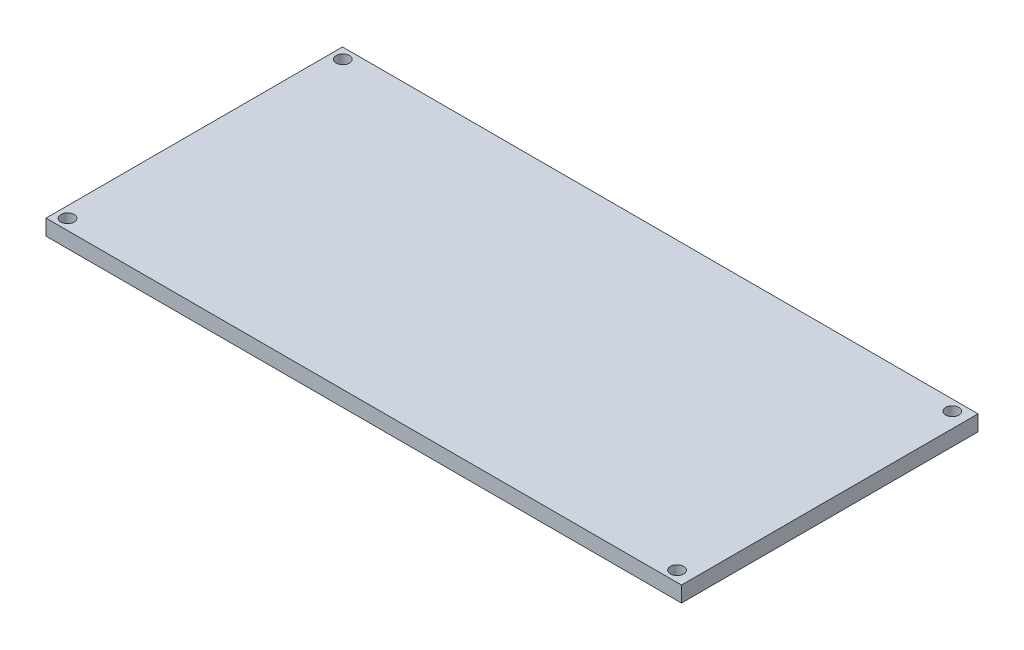
ISO-10303-21;
HEADER;
FILE_DESCRIPTION(('STEP AP214'),'2;1');
FILE_NAME('part.step','',(''),(''),'','','');
FILE_SCHEMA(('AUTOMOTIVE_DESIGN { 1 0 10303 214 1 1 1 1 }'));
ENDSEC;
DATA;
#1=APPLICATION_CONTEXT('core data for automotive mechanical design processes');
#2=APPLICATION_PROTOCOL_DEFINITION('international standard','automotive_design',2000,#1);
#3=PRODUCT_CONTEXT('',#1,'mechanical');
#4=PRODUCT('Part','Part','',(#3));
#5=PRODUCT_RELATED_PRODUCT_CATEGORY('part','',(#4));
#6=PRODUCT_DEFINITION_FORMATION('','',#4);
#7=PRODUCT_DEFINITION_CONTEXT('part definition',#1,'design');
#8=PRODUCT_DEFINITION('design','',#6,#7);
#9=PRODUCT_DEFINITION_SHAPE('','',#8);
#10=(LENGTH_UNIT() NAMED_UNIT(*) SI_UNIT(.MILLI.,.METRE.));
#11=(NAMED_UNIT(*) PLANE_ANGLE_UNIT() SI_UNIT($,.RADIAN.));
#12=(NAMED_UNIT(*) SI_UNIT($,.STERADIAN.) SOLID_ANGLE_UNIT());
#13=UNCERTAINTY_MEASURE_WITH_UNIT(LENGTH_MEASURE(1.E-05),#10,'distance_accuracy_value','');
#14=(GEOMETRIC_REPRESENTATION_CONTEXT(3) GLOBAL_UNCERTAINTY_ASSIGNED_CONTEXT((#13)) GLOBAL_UNIT_ASSIGNED_CONTEXT((#10,
#11,#12)) REPRESENTATION_CONTEXT('',''));
#15=CARTESIAN_POINT('',(0.,0.,0.));
#16=DIRECTION('',(0.,0.,1.));
#17=DIRECTION('',(1.,0.,0.));
#18=AXIS2_PLACEMENT_3D('',#15,#16,#17);
#19=CARTESIAN_POINT('',(-56.86,2.95,-27.95));
#20=DIRECTION('',(1.,0.,0.));
#21=DIRECTION('',(0.,0.,-1.));
#22=AXIS2_PLACEMENT_3D('',#19,#20,#21);
#23=PLANE('',#22);
#24=DIRECTION('',(0.,0.,1.));
#25=VECTOR('',#24,1.);
#26=CARTESIAN_POINT('',(-56.86,0.,-27.95));
#27=LINE('',#26,#25);
#28=CARTESIAN_POINT('',(-56.86,0.,-27.95));
#29=VERTEX_POINT('',#28);
#30=CARTESIAN_POINT('',(-56.86,0.,27.95));
#31=VERTEX_POINT('',#30);
#32=EDGE_CURVE('E99',#29,#31,#27,.T.);
#33=ORIENTED_EDGE('',*,*,#32,.T.);
#34=DIRECTION('',(0.,-1.,0.));
#35=VECTOR('',#34,1.);
#36=CARTESIAN_POINT('',(-56.86,2.95,27.95));
#37=LINE('',#36,#35);
#38=CARTESIAN_POINT('',(-56.86,2.95,27.95));
#39=VERTEX_POINT('',#38);
#40=EDGE_CURVE('E11',#39,#31,#37,.T.);
#41=ORIENTED_EDGE('',*,*,#40,.F.);
#42=DIRECTION('',(0.,0.,1.));
#43=VECTOR('',#42,1.);
#44=CARTESIAN_POINT('',(-56.86,2.95,-27.95));
#45=LINE('',#44,#43);
#46=CARTESIAN_POINT('',(-56.86,2.95,-27.95));
#47=VERTEX_POINT('',#46);
#48=EDGE_CURVE('E86',#47,#39,#45,.T.);
#49=ORIENTED_EDGE('',*,*,#48,.F.);
#50=DIRECTION('',(0.,-1.,0.));
#51=VECTOR('',#50,1.);
#52=CARTESIAN_POINT('',(-56.86,2.95,-27.95));
#53=LINE('',#52,#51);
#54=EDGE_CURVE('E95',#47,#29,#53,.T.);
#55=ORIENTED_EDGE('',*,*,#54,.T.);
#56=EDGE_LOOP('',(#33,#41,#49,#55));
#57=FACE_BOUND('',#56,.T.);
#58=ADVANCED_FACE('F33',(#57),#23,.F.);
#59=CARTESIAN_POINT('',(-56.86,2.95,27.95));
#60=DIRECTION('',(0.,0.,-1.));
#61=DIRECTION('',(-1.,0.,0.));
#62=AXIS2_PLACEMENT_3D('',#59,#60,#61);
#63=PLANE('',#62);
#64=DIRECTION('',(1.,0.,0.));
#65=VECTOR('',#64,1.);
#66=CARTESIAN_POINT('',(-56.86,0.,27.95));
#67=LINE('',#66,#65);
#68=CARTESIAN_POINT('',(62.95,0.,27.95));
#69=VERTEX_POINT('',#68);
#70=EDGE_CURVE('E90',#31,#69,#67,.T.);
#71=ORIENTED_EDGE('',*,*,#70,.T.);
#72=DIRECTION('',(0.,-1.,0.));
#73=VECTOR('',#72,1.);
#74=CARTESIAN_POINT('',(62.95,2.95,27.95));
#75=LINE('',#74,#73);
#76=CARTESIAN_POINT('',(62.95,2.95,27.95));
#77=VERTEX_POINT('',#76);
#78=EDGE_CURVE('E42',#77,#69,#75,.T.);
#79=ORIENTED_EDGE('',*,*,#78,.F.);
#80=DIRECTION('',(1.,0.,0.));
#81=VECTOR('',#80,1.);
#82=CARTESIAN_POINT('',(-56.86,2.95,27.95));
#83=LINE('',#82,#81);
#84=EDGE_CURVE('E81',#39,#77,#83,.T.);
#85=ORIENTED_EDGE('',*,*,#84,.F.);
#86=ORIENTED_EDGE('',*,*,#40,.T.);
#87=EDGE_LOOP('',(#71,#79,#85,#86));
#88=FACE_BOUND('',#87,.T.);
#89=ADVANCED_FACE('F89',(#88),#63,.F.);
#90=CARTESIAN_POINT('',(62.95,2.95,-27.95));
#91=DIRECTION('',(-1.,0.,0.));
#92=DIRECTION('',(0.,0.,1.));
#93=AXIS2_PLACEMENT_3D('',#90,#91,#92);
#94=PLANE('',#93);
#95=DIRECTION('',(0.,0.,-1.));
#96=VECTOR('',#95,1.);
#97=CARTESIAN_POINT('',(62.95,0.,-27.95));
#98=LINE('',#97,#96);
#99=CARTESIAN_POINT('',(62.95,0.,-27.95));
#100=VERTEX_POINT('',#99);
#101=EDGE_CURVE('E68',#69,#100,#98,.T.);
#102=ORIENTED_EDGE('',*,*,#101,.T.);
#103=DIRECTION('',(0.,-1.,0.));
#104=VECTOR('',#103,1.);
#105=CARTESIAN_POINT('',(62.95,2.95,-27.95));
#106=LINE('',#105,#104);
#107=CARTESIAN_POINT('',(62.95,2.95,-27.95));
#108=VERTEX_POINT('',#107);
#109=EDGE_CURVE('E91',#108,#100,#106,.T.);
#110=ORIENTED_EDGE('',*,*,#109,.F.);
#111=DIRECTION('',(0.,0.,-1.));
#112=VECTOR('',#111,1.);
#113=CARTESIAN_POINT('',(62.95,2.95,-27.95));
#114=LINE('',#113,#112);
#115=EDGE_CURVE('E84',#77,#108,#114,.T.);
#116=ORIENTED_EDGE('',*,*,#115,.F.);
#117=ORIENTED_EDGE('',*,*,#78,.T.);
#118=EDGE_LOOP('',(#102,#110,#116,#117));
#119=FACE_BOUND('',#118,.T.);
#120=ADVANCED_FACE('F93',(#119),#94,.F.);
#121=CARTESIAN_POINT('',(-56.86,2.95,-27.95));
#122=DIRECTION('',(0.,0.,1.));
#123=DIRECTION('',(1.,0.,0.));
#124=AXIS2_PLACEMENT_3D('',#121,#122,#123);
#125=PLANE('',#124);
#126=DIRECTION('',(-1.,0.,0.));
#127=VECTOR('',#126,1.);
#128=CARTESIAN_POINT('',(-56.86,0.,-27.95));
#129=LINE('',#128,#127);
#130=EDGE_CURVE('E74',#100,#29,#129,.T.);
#131=ORIENTED_EDGE('',*,*,#130,.T.);
#132=ORIENTED_EDGE('',*,*,#54,.F.);
#133=DIRECTION('',(-1.,0.,0.));
#134=VECTOR('',#133,1.);
#135=CARTESIAN_POINT('',(-56.86,2.95,-27.95));
#136=LINE('',#135,#134);
#137=EDGE_CURVE('E51',#108,#47,#136,.T.);
#138=ORIENTED_EDGE('',*,*,#137,.F.);
#139=ORIENTED_EDGE('',*,*,#109,.T.);
#140=EDGE_LOOP('',(#131,#132,#138,#139));
#141=FACE_BOUND('',#140,.T.);
#142=ADVANCED_FACE('F151',(#141),#125,.F.);
#143=CARTESIAN_POINT('',(0.,2.95,0.));
#144=DIRECTION('',(0.,1.,0.));
#145=DIRECTION('',(0.,0.,1.));
#146=AXIS2_PLACEMENT_3D('',#143,#144,#145);
#147=PLANE('',#146);
#148=CARTESIAN_POINT('',(60.11,2.95,25.9499999999996));
#149=DIRECTION('',(0.,1.,0.));
#150=DIRECTION('',(0.,0.,1.));
#151=AXIS2_PLACEMENT_3D('',#148,#149,#150);
#152=CIRCLE('',#151,1.25);
#153=CARTESIAN_POINT('',(60.11,2.95,27.1999999999996));
#154=VERTEX_POINT('',#153);
#155=EDGE_CURVE('E215',#154,#154,#152,.T.);
#156=ORIENTED_EDGE('',*,*,#155,.F.);
#157=EDGE_LOOP('',(#156));
#158=FACE_BOUND('',#157,.T.);
#159=CARTESIAN_POINT('',(-54.8021131975016,2.95,-25.95));
#160=DIRECTION('',(0.,1.,0.));
#161=DIRECTION('',(0.,0.,1.));
#162=AXIS2_PLACEMENT_3D('',#159,#160,#161);
#163=CIRCLE('',#162,1.25);
#164=CARTESIAN_POINT('',(-54.8021131975016,2.95,-24.7));
#165=VERTEX_POINT('',#164);
#166=EDGE_CURVE('E212',#165,#165,#163,.T.);
#167=ORIENTED_EDGE('',*,*,#166,.F.);
#168=EDGE_LOOP('',(#167));
#169=FACE_BOUND('',#168,.T.);
#170=CARTESIAN_POINT('',(60.1078868024984,2.95,-25.95));
#171=DIRECTION('',(0.,1.,0.));
#172=DIRECTION('',(0.,0.,1.));
#173=AXIS2_PLACEMENT_3D('',#170,#171,#172);
#174=CIRCLE('',#173,1.25);
#175=CARTESIAN_POINT('',(60.1078868024984,2.95,-24.7));
#176=VERTEX_POINT('',#175);
#177=EDGE_CURVE('E205',#176,#176,#174,.T.);
#178=ORIENTED_EDGE('',*,*,#177,.F.);
#179=EDGE_LOOP('',(#178));
#180=FACE_BOUND('',#179,.T.);
#181=CARTESIAN_POINT('',(-54.8021131975014,2.95,25.95));
#182=DIRECTION('',(0.,1.,0.));
#183=DIRECTION('',(0.,0.,1.));
#184=AXIS2_PLACEMENT_3D('',#181,#182,#183);
#185=CIRCLE('',#184,1.25);
#186=CARTESIAN_POINT('',(-54.8021131975014,2.95,27.2));
#187=VERTEX_POINT('',#186);
#188=EDGE_CURVE('E111',#187,#187,#185,.T.);
#189=ORIENTED_EDGE('',*,*,#188,.F.);
#190=EDGE_LOOP('',(#189));
#191=FACE_BOUND('',#190,.T.);
#192=ORIENTED_EDGE('',*,*,#48,.T.);
#193=ORIENTED_EDGE('',*,*,#84,.T.);
#194=ORIENTED_EDGE('',*,*,#115,.T.);
#195=ORIENTED_EDGE('',*,*,#137,.T.);
#196=EDGE_LOOP('',(#192,#193,#194,#195));
#197=FACE_BOUND('',#196,.T.);
#198=ADVANCED_FACE('F82',(#158,#169,#180,#191,#197),#147,.T.);
#199=CARTESIAN_POINT('',(0.,0.,0.));
#200=DIRECTION('',(0.,1.,0.));
#201=DIRECTION('',(0.,0.,1.));
#202=AXIS2_PLACEMENT_3D('',#199,#200,#201);
#203=PLANE('',#202);
#204=CARTESIAN_POINT('',(60.11,0.,25.9499999999996));
#205=DIRECTION('',(0.,1.,0.));
#206=DIRECTION('',(0.,0.,1.));
#207=AXIS2_PLACEMENT_3D('',#204,#205,#206);
#208=CIRCLE('',#207,1.25);
#209=CARTESIAN_POINT('',(60.11,0.,27.1999999999996));
#210=VERTEX_POINT('',#209);
#211=EDGE_CURVE('E36',#210,#210,#208,.T.);
#212=ORIENTED_EDGE('',*,*,#211,.T.);
#213=EDGE_LOOP('',(#212));
#214=FACE_BOUND('',#213,.T.);
#215=CARTESIAN_POINT('',(-54.8021131975016,0.,-25.95));
#216=DIRECTION('',(0.,1.,0.));
#217=DIRECTION('',(0.,0.,1.));
#218=AXIS2_PLACEMENT_3D('',#215,#216,#217);
#219=CIRCLE('',#218,1.25);
#220=CARTESIAN_POINT('',(-54.8021131975016,0.,-24.7));
#221=VERTEX_POINT('',#220);
#222=EDGE_CURVE('E113',#221,#221,#219,.T.);
#223=ORIENTED_EDGE('',*,*,#222,.T.);
#224=EDGE_LOOP('',(#223));
#225=FACE_BOUND('',#224,.T.);
#226=CARTESIAN_POINT('',(60.1078868024984,0.,-25.95));
#227=DIRECTION('',(0.,1.,0.));
#228=DIRECTION('',(0.,0.,1.));
#229=AXIS2_PLACEMENT_3D('',#226,#227,#228);
#230=CIRCLE('',#229,1.25);
#231=CARTESIAN_POINT('',(60.1078868024984,0.,-24.7));
#232=VERTEX_POINT('',#231);
#233=EDGE_CURVE('E110',#232,#232,#230,.T.);
#234=ORIENTED_EDGE('',*,*,#233,.T.);
#235=EDGE_LOOP('',(#234));
#236=FACE_BOUND('',#235,.T.);
#237=CARTESIAN_POINT('',(-54.8021131975014,0.,25.95));
#238=DIRECTION('',(0.,1.,0.));
#239=DIRECTION('',(0.,0.,1.));
#240=AXIS2_PLACEMENT_3D('',#237,#238,#239);
#241=CIRCLE('',#240,1.25);
#242=CARTESIAN_POINT('',(-54.8021131975014,0.,27.2));
#243=VERTEX_POINT('',#242);
#244=EDGE_CURVE('E107',#243,#243,#241,.T.);
#245=ORIENTED_EDGE('',*,*,#244,.T.);
#246=EDGE_LOOP('',(#245));
#247=FACE_BOUND('',#246,.T.);
#248=ORIENTED_EDGE('',*,*,#32,.F.);
#249=ORIENTED_EDGE('',*,*,#130,.F.);
#250=ORIENTED_EDGE('',*,*,#101,.F.);
#251=ORIENTED_EDGE('',*,*,#70,.F.);
#252=EDGE_LOOP('',(#248,#249,#250,#251));
#253=FACE_BOUND('',#252,.T.);
#254=ADVANCED_FACE('F120',(#214,#225,#236,#247,#253),#203,.F.);
#255=CARTESIAN_POINT('',(-54.8021131975014,-7.05,25.95));
#256=DIRECTION('',(0.,1.,0.));
#257=DIRECTION('',(0.,0.,1.));
#258=AXIS2_PLACEMENT_3D('',#255,#256,#257);
#259=CYLINDRICAL_SURFACE('',#258,1.25);
#260=ORIENTED_EDGE('',*,*,#188,.T.);
#261=EDGE_LOOP('',(#260));
#262=FACE_BOUND('',#261,.T.);
#263=ORIENTED_EDGE('',*,*,#244,.F.);
#264=EDGE_LOOP('',(#263));
#265=FACE_BOUND('',#264,.T.);
#266=ADVANCED_FACE('F143',(#262,#265),#259,.F.);
#267=CARTESIAN_POINT('',(60.1078868024984,-7.05,-25.95));
#268=DIRECTION('',(0.,1.,0.));
#269=DIRECTION('',(0.,0.,1.));
#270=AXIS2_PLACEMENT_3D('',#267,#268,#269);
#271=CYLINDRICAL_SURFACE('',#270,1.25);
#272=ORIENTED_EDGE('',*,*,#177,.T.);
#273=EDGE_LOOP('',(#272));
#274=FACE_BOUND('',#273,.T.);
#275=ORIENTED_EDGE('',*,*,#233,.F.);
#276=EDGE_LOOP('',(#275));
#277=FACE_BOUND('',#276,.T.);
#278=ADVANCED_FACE('F130',(#274,#277),#271,.F.);
#279=CARTESIAN_POINT('',(-54.8021131975016,-7.05,-25.95));
#280=DIRECTION('',(0.,1.,0.));
#281=DIRECTION('',(0.,0.,1.));
#282=AXIS2_PLACEMENT_3D('',#279,#280,#281);
#283=CYLINDRICAL_SURFACE('',#282,1.25);
#284=ORIENTED_EDGE('',*,*,#166,.T.);
#285=EDGE_LOOP('',(#284));
#286=FACE_BOUND('',#285,.T.);
#287=ORIENTED_EDGE('',*,*,#222,.F.);
#288=EDGE_LOOP('',(#287));
#289=FACE_BOUND('',#288,.T.);
#290=ADVANCED_FACE('F124',(#286,#289),#283,.F.);
#291=CARTESIAN_POINT('',(60.11,-7.05,25.9499999999996));
#292=DIRECTION('',(0.,1.,0.));
#293=DIRECTION('',(0.,0.,1.));
#294=AXIS2_PLACEMENT_3D('',#291,#292,#293);
#295=CYLINDRICAL_SURFACE('',#294,1.25);
#296=ORIENTED_EDGE('',*,*,#155,.T.);
#297=EDGE_LOOP('',(#296));
#298=FACE_BOUND('',#297,.T.);
#299=ORIENTED_EDGE('',*,*,#211,.F.);
#300=EDGE_LOOP('',(#299));
#301=FACE_BOUND('',#300,.T.);
#302=ADVANCED_FACE('F122',(#298,#301),#295,.F.);
#303=CLOSED_SHELL('',(#58,#89,#120,#142,#198,#254,#266,#278,#290,#302));
#304=MANIFOLD_SOLID_BREP('B2',#303);
#305=ADVANCED_BREP_SHAPE_REPRESENTATION('',(#18,#304),#14);
#306=SHAPE_DEFINITION_REPRESENTATION(#9,#305);
ENDSEC;
END-ISO-10303-21;
